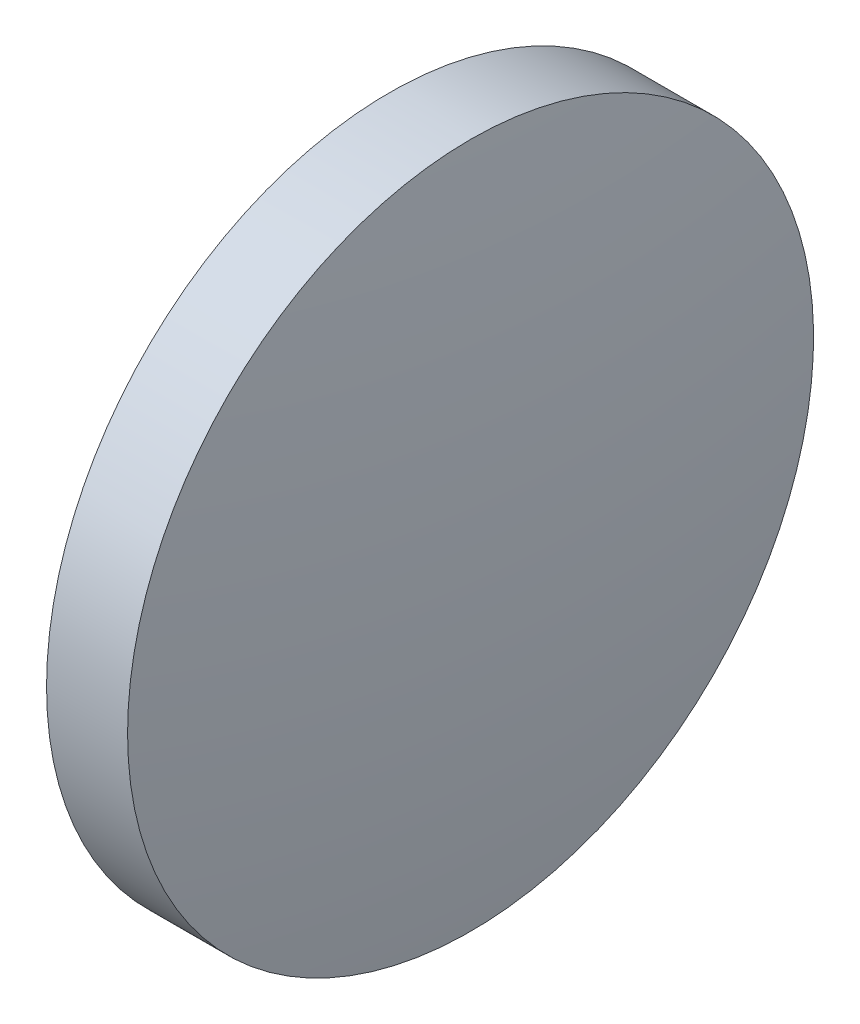
ISO-10303-21;
HEADER;
FILE_DESCRIPTION(('STEP AP214'),'2;1');
FILE_NAME('part.step','',(''),(''),'','','');
FILE_SCHEMA(('AUTOMOTIVE_DESIGN { 1 0 10303 214 1 1 1 1 }'));
ENDSEC;
DATA;
#1=APPLICATION_CONTEXT('core data for automotive mechanical design processes');
#2=APPLICATION_PROTOCOL_DEFINITION('international standard','automotive_design',2000,#1);
#3=PRODUCT_CONTEXT('',#1,'mechanical');
#4=PRODUCT('Part','Part','',(#3));
#5=PRODUCT_RELATED_PRODUCT_CATEGORY('part','',(#4));
#6=PRODUCT_DEFINITION_FORMATION('','',#4);
#7=PRODUCT_DEFINITION_CONTEXT('part definition',#1,'design');
#8=PRODUCT_DEFINITION('design','',#6,#7);
#9=PRODUCT_DEFINITION_SHAPE('','',#8);
#10=(LENGTH_UNIT() NAMED_UNIT(*) SI_UNIT(.MILLI.,.METRE.));
#11=(NAMED_UNIT(*) PLANE_ANGLE_UNIT() SI_UNIT($,.RADIAN.));
#12=(NAMED_UNIT(*) SI_UNIT($,.STERADIAN.) SOLID_ANGLE_UNIT());
#13=UNCERTAINTY_MEASURE_WITH_UNIT(LENGTH_MEASURE(1.E-05),#10,'distance_accuracy_value','');
#14=(GEOMETRIC_REPRESENTATION_CONTEXT(3) GLOBAL_UNCERTAINTY_ASSIGNED_CONTEXT((#13)) GLOBAL_UNIT_ASSIGNED_CONTEXT((#10,
#11,#12)) REPRESENTATION_CONTEXT('',''));
#15=CARTESIAN_POINT('',(0.,0.,0.));
#16=DIRECTION('',(0.,0.,1.));
#17=DIRECTION('',(1.,0.,0.));
#18=AXIS2_PLACEMENT_3D('',#15,#16,#17);
#19=CARTESIAN_POINT('',(27.8566064308381,65.2335549264122,0.));
#20=DIRECTION('',(-1.,0.,0.));
#21=DIRECTION('',(0.,1.,0.));
#22=AXIS2_PLACEMENT_3D('',#19,#20,#21);
#23=SPHERICAL_SURFACE('',#22,91.8);
#24=CARTESIAN_POINT('',(118.773876517439,65.2335549264122,0.));
#25=DIRECTION('',(-1.,0.,0.));
#26=DIRECTION('',(0.,0.,1.));
#27=AXIS2_PLACEMENT_3D('',#24,#25,#26);
#28=CIRCLE('',#27,12.7);
#29=CARTESIAN_POINT('',(118.773876517439,65.2335549264122,12.7));
#30=VERTEX_POINT('',#29);
#31=EDGE_CURVE('E10',#30,#30,#28,.T.);
#32=ORIENTED_EDGE('',*,*,#31,.F.);
#33=EDGE_LOOP('',(#32));
#34=FACE_BOUND('',#33,.T.);
#35=ADVANCED_FACE('F35',(#34),#23,.T.);
#36=CARTESIAN_POINT('',(110.165373228488,65.2335549264122,0.));
#37=DIRECTION('',(-1.,0.,0.));
#38=DIRECTION('',(0.,0.,1.));
#39=AXIS2_PLACEMENT_3D('',#36,#37,#38);
#40=CYLINDRICAL_SURFACE('',#39,12.7);
#41=CARTESIAN_POINT('',(115.773606430838,65.2335549264122,0.));
#42=DIRECTION('',(-1.,0.,0.));
#43=DIRECTION('',(0.,0.,1.));
#44=AXIS2_PLACEMENT_3D('',#41,#42,#43);
#45=CIRCLE('',#44,12.7);
#46=CARTESIAN_POINT('',(115.773606430838,65.2335549264122,12.7));
#47=VERTEX_POINT('',#46);
#48=EDGE_CURVE('E41',#47,#47,#45,.T.);
#49=ORIENTED_EDGE('',*,*,#48,.F.);
#50=EDGE_LOOP('',(#49));
#51=FACE_BOUND('',#50,.T.);
#52=ORIENTED_EDGE('',*,*,#31,.T.);
#53=EDGE_LOOP('',(#52));
#54=FACE_BOUND('',#53,.T.);
#55=ADVANCED_FACE('F49',(#51,#54),#40,.T.);
#56=CARTESIAN_POINT('',(115.773606430838,65.2335549264122,0.));
#57=DIRECTION('',(1.,0.,0.));
#58=DIRECTION('',(0.,0.,-1.));
#59=AXIS2_PLACEMENT_3D('',#56,#57,#58);
#60=PLANE('',#59);
#61=ORIENTED_EDGE('',*,*,#48,.T.);
#62=EDGE_LOOP('',(#61));
#63=FACE_BOUND('',#62,.T.);
#64=ADVANCED_FACE('F47',(#63),#60,.F.);
#65=CLOSED_SHELL('',(#35,#55,#64));
#66=MANIFOLD_SOLID_BREP('B2',#65);
#67=ADVANCED_BREP_SHAPE_REPRESENTATION('',(#18,#66),#14);
#68=SHAPE_DEFINITION_REPRESENTATION(#9,#67);
ENDSEC;
END-ISO-10303-21;
